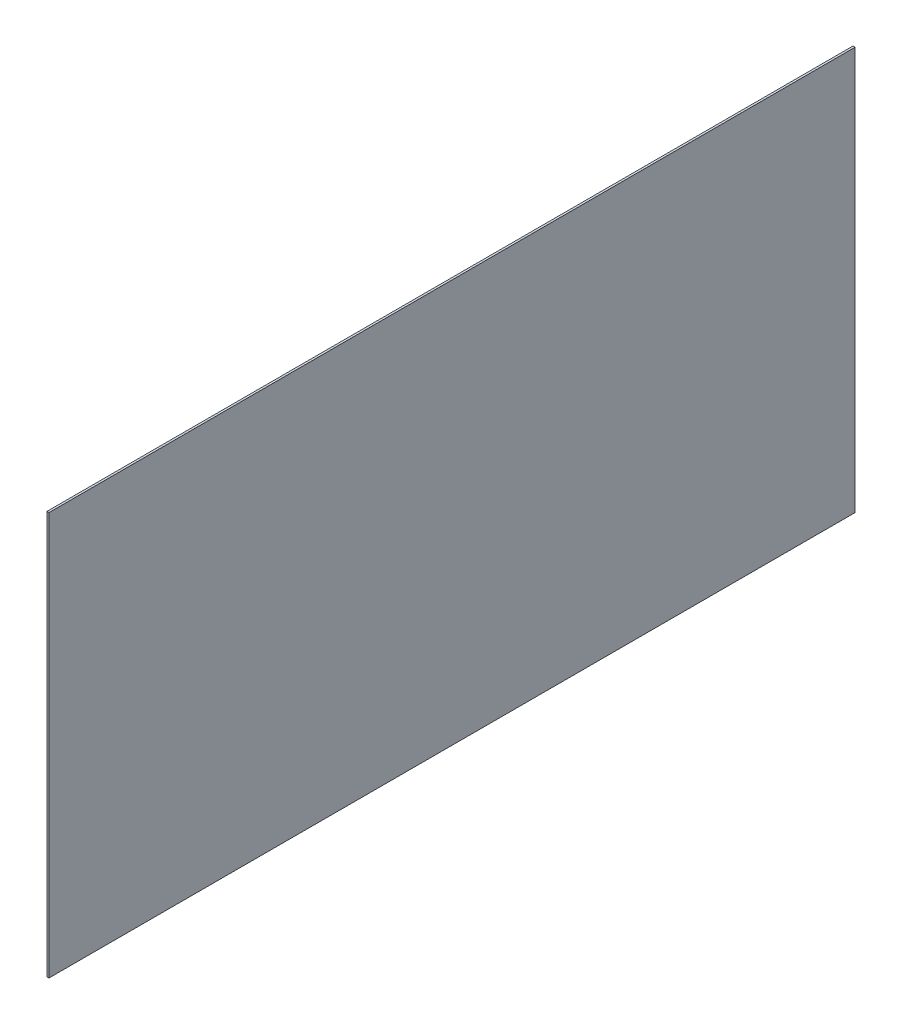
ISO-10303-21;
HEADER;
FILE_DESCRIPTION(('STEP AP214'),'2;1');
FILE_NAME('part.step','',(''),(''),'','','');
FILE_SCHEMA(('AUTOMOTIVE_DESIGN { 1 0 10303 214 1 1 1 1 }'));
ENDSEC;
DATA;
#1=APPLICATION_CONTEXT('core data for automotive mechanical design processes');
#2=APPLICATION_PROTOCOL_DEFINITION('international standard','automotive_design',2000,#1);
#3=PRODUCT_CONTEXT('',#1,'mechanical');
#4=PRODUCT('Part','Part','',(#3));
#5=PRODUCT_RELATED_PRODUCT_CATEGORY('part','',(#4));
#6=PRODUCT_DEFINITION_FORMATION('','',#4);
#7=PRODUCT_DEFINITION_CONTEXT('part definition',#1,'design');
#8=PRODUCT_DEFINITION('design','',#6,#7);
#9=PRODUCT_DEFINITION_SHAPE('','',#8);
#10=(LENGTH_UNIT() NAMED_UNIT(*) SI_UNIT(.MILLI.,.METRE.));
#11=(NAMED_UNIT(*) PLANE_ANGLE_UNIT() SI_UNIT($,.RADIAN.));
#12=(NAMED_UNIT(*) SI_UNIT($,.STERADIAN.) SOLID_ANGLE_UNIT());
#13=UNCERTAINTY_MEASURE_WITH_UNIT(LENGTH_MEASURE(1.E-05),#10,'distance_accuracy_value','');
#14=(GEOMETRIC_REPRESENTATION_CONTEXT(3) GLOBAL_UNCERTAINTY_ASSIGNED_CONTEXT((#13)) GLOBAL_UNIT_ASSIGNED_CONTEXT((#10,
#11,#12)) REPRESENTATION_CONTEXT('',''));
#15=CARTESIAN_POINT('',(0.,0.,0.));
#16=DIRECTION('',(0.,0.,1.));
#17=DIRECTION('',(1.,0.,0.));
#18=AXIS2_PLACEMENT_3D('',#15,#16,#17);
#19=CARTESIAN_POINT('',(4.7625,0.,0.));
#20=DIRECTION('',(0.,0.,-1.));
#21=DIRECTION('',(-1.,0.,0.));
#22=AXIS2_PLACEMENT_3D('',#19,#20,#21);
#23=PLANE('',#22);
#24=DIRECTION('',(0.,-1.,0.));
#25=VECTOR('',#24,1.);
#26=CARTESIAN_POINT('',(0.,0.,0.));
#27=LINE('',#26,#25);
#28=CARTESIAN_POINT('',(0.,914.4,0.));
#29=VERTEX_POINT('',#28);
#30=CARTESIAN_POINT('',(0.,0.,0.));
#31=VERTEX_POINT('',#30);
#32=EDGE_CURVE('E99',#29,#31,#27,.T.);
#33=ORIENTED_EDGE('',*,*,#32,.T.);
#34=DIRECTION('',(-1.,0.,0.));
#35=VECTOR('',#34,1.);
#36=CARTESIAN_POINT('',(4.7625,0.,0.));
#37=LINE('',#36,#35);
#38=CARTESIAN_POINT('',(4.7625,0.,0.));
#39=VERTEX_POINT('',#38);
#40=EDGE_CURVE('E11',#39,#31,#37,.T.);
#41=ORIENTED_EDGE('',*,*,#40,.F.);
#42=DIRECTION('',(0.,-1.,0.));
#43=VECTOR('',#42,1.);
#44=CARTESIAN_POINT('',(4.7625,0.,0.));
#45=LINE('',#44,#43);
#46=CARTESIAN_POINT('',(4.7625,914.4,0.));
#47=VERTEX_POINT('',#46);
#48=EDGE_CURVE('E87',#47,#39,#45,.T.);
#49=ORIENTED_EDGE('',*,*,#48,.F.);
#50=DIRECTION('',(-1.,0.,0.));
#51=VECTOR('',#50,1.);
#52=CARTESIAN_POINT('',(4.7625,914.4,0.));
#53=LINE('',#52,#51);
#54=EDGE_CURVE('E95',#47,#29,#53,.T.);
#55=ORIENTED_EDGE('',*,*,#54,.T.);
#56=EDGE_LOOP('',(#33,#41,#49,#55));
#57=FACE_BOUND('',#56,.T.);
#58=ADVANCED_FACE('F36',(#57),#23,.F.);
#59=CARTESIAN_POINT('',(4.7625,0.,0.));
#60=DIRECTION('',(0.,1.,0.));
#61=DIRECTION('',(0.,0.,1.));
#62=AXIS2_PLACEMENT_3D('',#59,#60,#61);
#63=PLANE('',#62);
#64=DIRECTION('',(0.,0.,-1.));
#65=VECTOR('',#64,1.);
#66=CARTESIAN_POINT('',(0.,0.,0.));
#67=LINE('',#66,#65);
#68=CARTESIAN_POINT('',(0.,0.,-1828.8));
#69=VERTEX_POINT('',#68);
#70=EDGE_CURVE('E91',#31,#69,#67,.T.);
#71=ORIENTED_EDGE('',*,*,#70,.T.);
#72=DIRECTION('',(-1.,0.,0.));
#73=VECTOR('',#72,1.);
#74=CARTESIAN_POINT('',(4.7625,0.,-1828.8));
#75=LINE('',#74,#73);
#76=CARTESIAN_POINT('',(4.7625,0.,-1828.8));
#77=VERTEX_POINT('',#76);
#78=EDGE_CURVE('E44',#77,#69,#75,.T.);
#79=ORIENTED_EDGE('',*,*,#78,.F.);
#80=DIRECTION('',(0.,0.,-1.));
#81=VECTOR('',#80,1.);
#82=CARTESIAN_POINT('',(4.7625,0.,0.));
#83=LINE('',#82,#81);
#84=EDGE_CURVE('E82',#39,#77,#83,.T.);
#85=ORIENTED_EDGE('',*,*,#84,.F.);
#86=ORIENTED_EDGE('',*,*,#40,.T.);
#87=EDGE_LOOP('',(#71,#79,#85,#86));
#88=FACE_BOUND('',#87,.T.);
#89=ADVANCED_FACE('F90',(#88),#63,.F.);
#90=CARTESIAN_POINT('',(4.7625,0.,-1828.8));
#91=DIRECTION('',(0.,0.,1.));
#92=DIRECTION('',(1.,0.,0.));
#93=AXIS2_PLACEMENT_3D('',#90,#91,#92);
#94=PLANE('',#93);
#95=DIRECTION('',(0.,1.,0.));
#96=VECTOR('',#95,1.);
#97=CARTESIAN_POINT('',(0.,0.,-1828.8));
#98=LINE('',#97,#96);
#99=CARTESIAN_POINT('',(0.,914.4,-1828.8));
#100=VERTEX_POINT('',#99);
#101=EDGE_CURVE('E69',#69,#100,#98,.T.);
#102=ORIENTED_EDGE('',*,*,#101,.T.);
#103=DIRECTION('',(-1.,0.,0.));
#104=VECTOR('',#103,1.);
#105=CARTESIAN_POINT('',(4.7625,914.4,-1828.8));
#106=LINE('',#105,#104);
#107=CARTESIAN_POINT('',(4.7625,914.4,-1828.8));
#108=VERTEX_POINT('',#107);
#109=EDGE_CURVE('E92',#108,#100,#106,.T.);
#110=ORIENTED_EDGE('',*,*,#109,.F.);
#111=DIRECTION('',(0.,1.,0.));
#112=VECTOR('',#111,1.);
#113=CARTESIAN_POINT('',(4.7625,0.,-1828.8));
#114=LINE('',#113,#112);
#115=EDGE_CURVE('E85',#77,#108,#114,.T.);
#116=ORIENTED_EDGE('',*,*,#115,.F.);
#117=ORIENTED_EDGE('',*,*,#78,.T.);
#118=EDGE_LOOP('',(#102,#110,#116,#117));
#119=FACE_BOUND('',#118,.T.);
#120=ADVANCED_FACE('F93',(#119),#94,.F.);
#121=CARTESIAN_POINT('',(4.7625,914.4,0.));
#122=DIRECTION('',(0.,-1.,0.));
#123=DIRECTION('',(0.,0.,-1.));
#124=AXIS2_PLACEMENT_3D('',#121,#122,#123);
#125=PLANE('',#124);
#126=DIRECTION('',(0.,0.,1.));
#127=VECTOR('',#126,1.);
#128=CARTESIAN_POINT('',(0.,914.4,0.));
#129=LINE('',#128,#127);
#130=EDGE_CURVE('E75',#100,#29,#129,.T.);
#131=ORIENTED_EDGE('',*,*,#130,.T.);
#132=ORIENTED_EDGE('',*,*,#54,.F.);
#133=DIRECTION('',(0.,0.,1.));
#134=VECTOR('',#133,1.);
#135=CARTESIAN_POINT('',(4.7625,914.4,0.));
#136=LINE('',#135,#134);
#137=EDGE_CURVE('E52',#108,#47,#136,.T.);
#138=ORIENTED_EDGE('',*,*,#137,.F.);
#139=ORIENTED_EDGE('',*,*,#109,.T.);
#140=EDGE_LOOP('',(#131,#132,#138,#139));
#141=FACE_BOUND('',#140,.T.);
#142=ADVANCED_FACE('F106',(#141),#125,.F.);
#143=CARTESIAN_POINT('',(4.7625,0.,0.));
#144=DIRECTION('',(-1.,0.,0.));
#145=DIRECTION('',(0.,0.,1.));
#146=AXIS2_PLACEMENT_3D('',#143,#144,#145);
#147=PLANE('',#146);
#148=ORIENTED_EDGE('',*,*,#48,.T.);
#149=ORIENTED_EDGE('',*,*,#84,.T.);
#150=ORIENTED_EDGE('',*,*,#115,.T.);
#151=ORIENTED_EDGE('',*,*,#137,.T.);
#152=EDGE_LOOP('',(#148,#149,#150,#151));
#153=FACE_BOUND('',#152,.T.);
#154=ADVANCED_FACE('F83',(#153),#147,.F.);
#155=CARTESIAN_POINT('',(0.,0.,0.));
#156=DIRECTION('',(-1.,0.,0.));
#157=DIRECTION('',(0.,0.,1.));
#158=AXIS2_PLACEMENT_3D('',#155,#156,#157);
#159=PLANE('',#158);
#160=ORIENTED_EDGE('',*,*,#32,.F.);
#161=ORIENTED_EDGE('',*,*,#130,.F.);
#162=ORIENTED_EDGE('',*,*,#101,.F.);
#163=ORIENTED_EDGE('',*,*,#70,.F.);
#164=EDGE_LOOP('',(#160,#161,#162,#163));
#165=FACE_BOUND('',#164,.T.);
#166=ADVANCED_FACE('F109',(#165),#159,.T.);
#167=CLOSED_SHELL('',(#58,#89,#120,#142,#154,#166));
#168=MANIFOLD_SOLID_BREP('B2',#167);
#169=ADVANCED_BREP_SHAPE_REPRESENTATION('',(#18,#168),#14);
#170=SHAPE_DEFINITION_REPRESENTATION(#9,#169);
ENDSEC;
END-ISO-10303-21;
